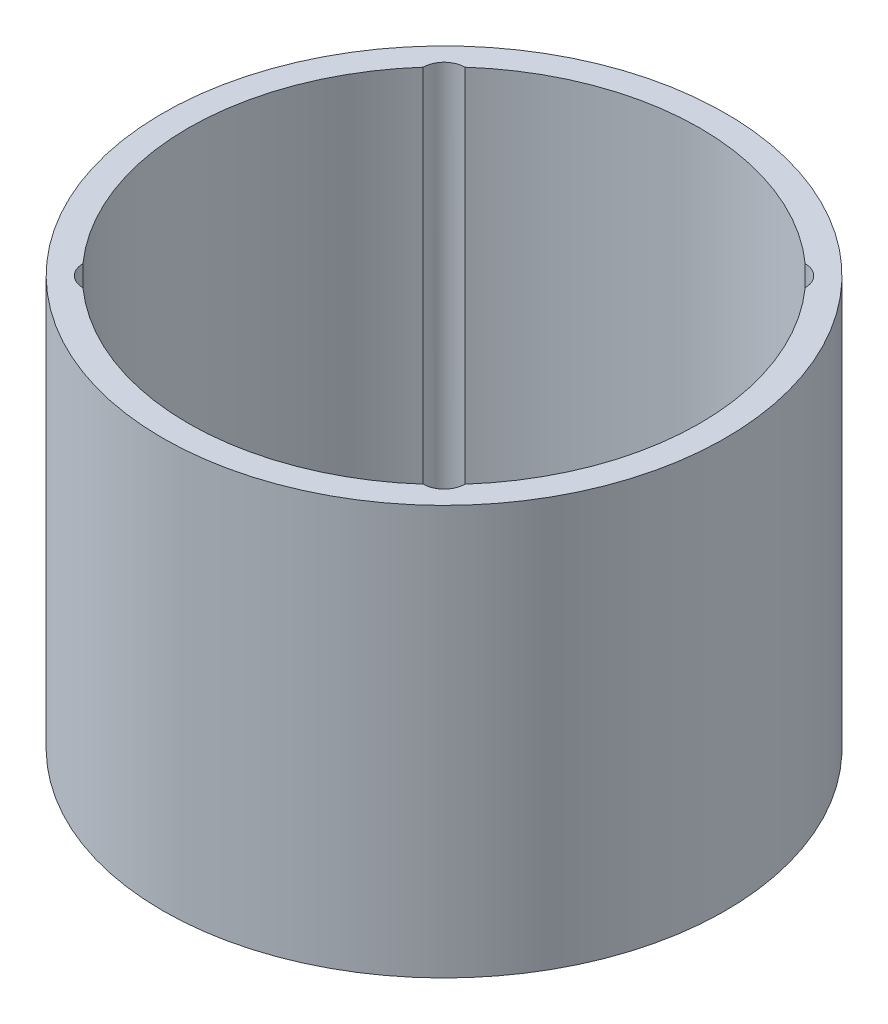
ISO-10303-21;
HEADER;
FILE_DESCRIPTION(('STEP AP214'),'2;1');
FILE_NAME('part.step','',(''),(''),'','','');
FILE_SCHEMA(('AUTOMOTIVE_DESIGN { 1 0 10303 214 1 1 1 1 }'));
ENDSEC;
DATA;
#1=APPLICATION_CONTEXT('core data for automotive mechanical design processes');
#2=APPLICATION_PROTOCOL_DEFINITION('international standard','automotive_design',2000,#1);
#3=PRODUCT_CONTEXT('',#1,'mechanical');
#4=PRODUCT('Part','Part','',(#3));
#5=PRODUCT_RELATED_PRODUCT_CATEGORY('part','',(#4));
#6=PRODUCT_DEFINITION_FORMATION('','',#4);
#7=PRODUCT_DEFINITION_CONTEXT('part definition',#1,'design');
#8=PRODUCT_DEFINITION('design','',#6,#7);
#9=PRODUCT_DEFINITION_SHAPE('','',#8);
#10=(LENGTH_UNIT() NAMED_UNIT(*) SI_UNIT(.MILLI.,.METRE.));
#11=(NAMED_UNIT(*) PLANE_ANGLE_UNIT() SI_UNIT($,.RADIAN.));
#12=(NAMED_UNIT(*) SI_UNIT($,.STERADIAN.) SOLID_ANGLE_UNIT());
#13=UNCERTAINTY_MEASURE_WITH_UNIT(LENGTH_MEASURE(1.E-05),#10,'distance_accuracy_value','');
#14=(GEOMETRIC_REPRESENTATION_CONTEXT(3) GLOBAL_UNCERTAINTY_ASSIGNED_CONTEXT((#13)) GLOBAL_UNIT_ASSIGNED_CONTEXT((#10,
#11,#12)) REPRESENTATION_CONTEXT('',''));
#15=CARTESIAN_POINT('',(0.,0.,0.));
#16=DIRECTION('',(0.,0.,1.));
#17=DIRECTION('',(1.,0.,0.));
#18=AXIS2_PLACEMENT_3D('',#15,#16,#17);
#19=CARTESIAN_POINT('',(0.,80.,0.));
#20=DIRECTION('',(0.,-1.,0.));
#21=DIRECTION('',(0.,0.,-1.));
#22=AXIS2_PLACEMENT_3D('',#19,#20,#21);
#23=CYLINDRICAL_SURFACE('',#22,50.);
#24=DIRECTION('',(0.,1.,0.));
#25=VECTOR('',#24,1.);
#26=CARTESIAN_POINT('',(-33.2592368748973,40.,-37.3339411594793));
#27=LINE('',#26,#25);
#28=CARTESIAN_POINT('',(-33.2592368748973,5.,-37.3339411594794));
#29=VERTEX_POINT('',#28);
#30=CARTESIAN_POINT('',(-33.2592368748974,80.,-37.3339411594793));
#31=VERTEX_POINT('',#30);
#32=EDGE_CURVE('E160',#29,#31,#27,.T.);
#33=ORIENTED_EDGE('',*,*,#32,.F.);
#34=CARTESIAN_POINT('',(0.,5.,0.));
#35=DIRECTION('',(0.,1.,0.));
#36=DIRECTION('',(0.,0.,1.));
#37=AXIS2_PLACEMENT_3D('',#34,#35,#36);
#38=CIRCLE('',#37,50.);
#39=CARTESIAN_POINT('',(33.2592368748973,5.,-37.3339411594794));
#40=VERTEX_POINT('',#39);
#41=EDGE_CURVE('E148',#40,#29,#38,.T.);
#42=ORIENTED_EDGE('',*,*,#41,.F.);
#43=DIRECTION('',(0.,1.,0.));
#44=VECTOR('',#43,1.);
#45=CARTESIAN_POINT('',(33.2592368748973,40.,-37.3339411594793));
#46=LINE('',#45,#44);
#47=CARTESIAN_POINT('',(33.2592368748974,80.,-37.3339411594793));
#48=VERTEX_POINT('',#47);
#49=EDGE_CURVE('E57',#48,#40,#46,.F.);
#50=ORIENTED_EDGE('',*,*,#49,.F.);
#51=CARTESIAN_POINT('',(0.,80.,0.));
#52=DIRECTION('',(0.,1.,0.));
#53=DIRECTION('',(0.,0.,1.));
#54=AXIS2_PLACEMENT_3D('',#51,#52,#53);
#55=CIRCLE('',#54,50.);
#56=EDGE_CURVE('E134',#48,#31,#55,.T.);
#57=ORIENTED_EDGE('',*,*,#56,.T.);
#58=EDGE_LOOP('',(#33,#42,#50,#57));
#59=FACE_BOUND('',#58,.T.);
#60=ADVANCED_FACE('F35',(#59),#23,.F.);
#61=DIRECTION('',(0.,1.,0.));
#62=VECTOR('',#61,1.);
#63=CARTESIAN_POINT('',(37.3339411594793,40.,-33.2592368748973));
#64=LINE('',#63,#62);
#65=CARTESIAN_POINT('',(37.3339411594794,5.,-33.2592368748973));
#66=VERTEX_POINT('',#65);
#67=CARTESIAN_POINT('',(37.3339411594793,80.,-33.2592368748974));
#68=VERTEX_POINT('',#67);
#69=EDGE_CURVE('E165',#66,#68,#64,.T.);
#70=ORIENTED_EDGE('',*,*,#69,.F.);
#71=CARTESIAN_POINT('',(37.3339411594794,5.,33.2592368748973));
#72=VERTEX_POINT('',#71);
#73=EDGE_CURVE('E143',#72,#66,#38,.T.);
#74=ORIENTED_EDGE('',*,*,#73,.F.);
#75=DIRECTION('',(0.,1.,0.));
#76=VECTOR('',#75,1.);
#77=CARTESIAN_POINT('',(37.3339411594794,40.,33.2592368748973));
#78=LINE('',#77,#76);
#79=CARTESIAN_POINT('',(37.3339411594794,80.,33.2592368748974));
#80=VERTEX_POINT('',#79);
#81=EDGE_CURVE('E110',#80,#72,#78,.F.);
#82=ORIENTED_EDGE('',*,*,#81,.F.);
#83=EDGE_CURVE('E122',#80,#68,#55,.T.);
#84=ORIENTED_EDGE('',*,*,#83,.T.);
#85=EDGE_LOOP('',(#70,#74,#82,#84));
#86=FACE_BOUND('',#85,.T.);
#87=ADVANCED_FACE('F194',(#86),#23,.F.);
#88=DIRECTION('',(0.,1.,0.));
#89=VECTOR('',#88,1.);
#90=CARTESIAN_POINT('',(33.2592368748973,40.,37.3339411594793));
#91=LINE('',#90,#89);
#92=CARTESIAN_POINT('',(33.2592368748973,5.,37.3339411594794));
#93=VERTEX_POINT('',#92);
#94=CARTESIAN_POINT('',(33.2592368748974,80.,37.3339411594793));
#95=VERTEX_POINT('',#94);
#96=EDGE_CURVE('E98',#93,#95,#91,.T.);
#97=ORIENTED_EDGE('',*,*,#96,.F.);
#98=CARTESIAN_POINT('',(-33.2592368748973,5.,37.3339411594794));
#99=VERTEX_POINT('',#98);
#100=EDGE_CURVE('E137',#99,#93,#38,.T.);
#101=ORIENTED_EDGE('',*,*,#100,.F.);
#102=DIRECTION('',(0.,1.,0.));
#103=VECTOR('',#102,1.);
#104=CARTESIAN_POINT('',(-33.2592368748973,40.,37.3339411594793));
#105=LINE('',#104,#103);
#106=CARTESIAN_POINT('',(-33.2592368748974,80.,37.3339411594793));
#107=VERTEX_POINT('',#106);
#108=EDGE_CURVE('E127',#107,#99,#105,.F.);
#109=ORIENTED_EDGE('',*,*,#108,.F.);
#110=EDGE_CURVE('E119',#107,#95,#55,.T.);
#111=ORIENTED_EDGE('',*,*,#110,.T.);
#112=EDGE_LOOP('',(#97,#101,#109,#111));
#113=FACE_BOUND('',#112,.T.);
#114=ADVANCED_FACE('F126',(#113),#23,.F.);
#115=CARTESIAN_POINT('',(0.,80.,0.));
#116=DIRECTION('',(0.,-1.,0.));
#117=DIRECTION('',(0.,0.,-1.));
#118=AXIS2_PLACEMENT_3D('',#115,#116,#117);
#119=CYLINDRICAL_SURFACE('',#118,55.);
#120=CARTESIAN_POINT('',(0.,80.,0.));
#121=DIRECTION('',(0.,1.,0.));
#122=DIRECTION('',(0.,0.,1.));
#123=AXIS2_PLACEMENT_3D('',#120,#121,#122);
#124=CIRCLE('',#123,55.);
#125=CARTESIAN_POINT('',(0.,80.,55.));
#126=VERTEX_POINT('',#125);
#127=EDGE_CURVE('E132',#126,#126,#124,.T.);
#128=ORIENTED_EDGE('',*,*,#127,.F.);
#129=EDGE_LOOP('',(#128));
#130=FACE_BOUND('',#129,.T.);
#131=CARTESIAN_POINT('',(0.,0.,0.));
#132=DIRECTION('',(0.,1.,0.));
#133=DIRECTION('',(0.,0.,1.));
#134=AXIS2_PLACEMENT_3D('',#131,#132,#133);
#135=CIRCLE('',#134,55.);
#136=CARTESIAN_POINT('',(0.,0.,55.));
#137=VERTEX_POINT('',#136);
#138=EDGE_CURVE('E128',#137,#137,#135,.T.);
#139=ORIENTED_EDGE('',*,*,#138,.T.);
#140=EDGE_LOOP('',(#139));
#141=FACE_BOUND('',#140,.T.);
#142=ADVANCED_FACE('F37',(#130,#141),#119,.T.);
#143=CARTESIAN_POINT('',(0.,80.,0.));
#144=DIRECTION('',(0.,1.,0.));
#145=DIRECTION('',(0.,0.,1.));
#146=AXIS2_PLACEMENT_3D('',#143,#144,#145);
#147=PLANE('',#146);
#148=CARTESIAN_POINT('',(-33.2340187157677,80.,-33.2340187157677));
#149=DIRECTION('',(0.,1.,0.));
#150=DIRECTION('',(0.,0.,1.));
#151=AXIS2_PLACEMENT_3D('',#148,#149,#150);
#152=CIRCLE('',#151,4.1);
#153=CARTESIAN_POINT('',(-37.3339411594793,80.,-33.2592368748974));
#154=VERTEX_POINT('',#153);
#155=EDGE_CURVE('E177',#31,#154,#152,.T.);
#156=ORIENTED_EDGE('',*,*,#155,.F.);
#157=ORIENTED_EDGE('',*,*,#56,.F.);
#158=CARTESIAN_POINT('',(33.2340187157677,80.,-33.2340187157677));
#159=DIRECTION('',(0.,1.,0.));
#160=DIRECTION('',(0.,0.,1.));
#161=AXIS2_PLACEMENT_3D('',#158,#159,#160);
#162=CIRCLE('',#161,4.1);
#163=EDGE_CURVE('E172',#68,#48,#162,.T.);
#164=ORIENTED_EDGE('',*,*,#163,.F.);
#165=ORIENTED_EDGE('',*,*,#83,.F.);
#166=CARTESIAN_POINT('',(33.2340187157677,80.,33.2340187157677));
#167=DIRECTION('',(0.,1.,0.));
#168=DIRECTION('',(0.,0.,1.));
#169=AXIS2_PLACEMENT_3D('',#166,#167,#168);
#170=CIRCLE('',#169,4.1);
#171=EDGE_CURVE('E102',#95,#80,#170,.T.);
#172=ORIENTED_EDGE('',*,*,#171,.F.);
#173=ORIENTED_EDGE('',*,*,#110,.F.);
#174=CARTESIAN_POINT('',(-33.2340187157677,80.,33.2340187157677));
#175=DIRECTION('',(0.,1.,0.));
#176=DIRECTION('',(0.,0.,1.));
#177=AXIS2_PLACEMENT_3D('',#174,#175,#176);
#178=CIRCLE('',#177,4.1);
#179=CARTESIAN_POINT('',(-37.3339411594793,80.,33.2592368748974));
#180=VERTEX_POINT('',#179);
#181=EDGE_CURVE('E158',#180,#107,#178,.T.);
#182=ORIENTED_EDGE('',*,*,#181,.F.);
#183=EDGE_CURVE('E130',#154,#180,#55,.T.);
#184=ORIENTED_EDGE('',*,*,#183,.F.);
#185=EDGE_LOOP('',(#156,#157,#164,#165,#172,#173,#182,#184));
#186=FACE_BOUND('',#185,.T.);
#187=ORIENTED_EDGE('',*,*,#127,.T.);
#188=EDGE_LOOP('',(#187));
#189=FACE_BOUND('',#188,.T.);
#190=ADVANCED_FACE('F116',(#186,#189),#147,.T.);
#191=CARTESIAN_POINT('',(0.,0.,0.));
#192=DIRECTION('',(0.,1.,0.));
#193=DIRECTION('',(0.,0.,1.));
#194=AXIS2_PLACEMENT_3D('',#191,#192,#193);
#195=PLANE('',#194);
#196=CARTESIAN_POINT('',(-33.2340187157677,0.,-33.2340187157677));
#197=DIRECTION('',(0.,1.,0.));
#198=DIRECTION('',(0.,0.,1.));
#199=AXIS2_PLACEMENT_3D('',#196,#197,#198);
#200=CIRCLE('',#199,4.1);
#201=CARTESIAN_POINT('',(-33.2340187157677,0.,-29.1340187157677));
#202=VERTEX_POINT('',#201);
#203=EDGE_CURVE('E168',#202,#202,#200,.T.);
#204=ORIENTED_EDGE('',*,*,#203,.T.);
#205=EDGE_LOOP('',(#204));
#206=FACE_BOUND('',#205,.T.);
#207=CARTESIAN_POINT('',(33.2340187157677,0.,-33.2340187157677));
#208=DIRECTION('',(0.,1.,0.));
#209=DIRECTION('',(0.,0.,1.));
#210=AXIS2_PLACEMENT_3D('',#207,#208,#209);
#211=CIRCLE('',#210,4.1);
#212=CARTESIAN_POINT('',(33.2340187157677,0.,-29.1340187157677));
#213=VERTEX_POINT('',#212);
#214=EDGE_CURVE('E174',#213,#213,#211,.T.);
#215=ORIENTED_EDGE('',*,*,#214,.T.);
#216=EDGE_LOOP('',(#215));
#217=FACE_BOUND('',#216,.T.);
#218=CARTESIAN_POINT('',(33.2340187157677,0.,33.2340187157677));
#219=DIRECTION('',(0.,1.,0.));
#220=DIRECTION('',(0.,0.,1.));
#221=AXIS2_PLACEMENT_3D('',#218,#219,#220);
#222=CIRCLE('',#221,4.1);
#223=CARTESIAN_POINT('',(33.2340187157677,0.,37.3340187157677));
#224=VERTEX_POINT('',#223);
#225=EDGE_CURVE('E123',#224,#224,#222,.T.);
#226=ORIENTED_EDGE('',*,*,#225,.T.);
#227=EDGE_LOOP('',(#226));
#228=FACE_BOUND('',#227,.T.);
#229=CARTESIAN_POINT('',(-33.2340187157677,0.,33.2340187157677));
#230=DIRECTION('',(0.,1.,0.));
#231=DIRECTION('',(0.,0.,1.));
#232=AXIS2_PLACEMENT_3D('',#229,#230,#231);
#233=CIRCLE('',#232,4.1);
#234=CARTESIAN_POINT('',(-33.2340187157677,0.,37.3340187157677));
#235=VERTEX_POINT('',#234);
#236=EDGE_CURVE('E155',#235,#235,#233,.T.);
#237=ORIENTED_EDGE('',*,*,#236,.T.);
#238=EDGE_LOOP('',(#237));
#239=FACE_BOUND('',#238,.T.);
#240=ORIENTED_EDGE('',*,*,#138,.F.);
#241=EDGE_LOOP('',(#240));
#242=FACE_BOUND('',#241,.T.);
#243=ADVANCED_FACE('F182',(#206,#217,#228,#239,#242),#195,.F.);
#244=DIRECTION('',(0.,1.,0.));
#245=VECTOR('',#244,1.);
#246=CARTESIAN_POINT('',(-37.3339411594793,40.,-33.2592368748973));
#247=LINE('',#246,#245);
#248=CARTESIAN_POINT('',(-37.3339411594794,5.,-33.2592368748973));
#249=VERTEX_POINT('',#248);
#250=EDGE_CURVE('E49',#154,#249,#247,.F.);
#251=ORIENTED_EDGE('',*,*,#250,.F.);
#252=ORIENTED_EDGE('',*,*,#183,.T.);
#253=DIRECTION('',(0.,1.,0.));
#254=VECTOR('',#253,1.);
#255=CARTESIAN_POINT('',(-37.3339411594793,40.,33.2592368748973));
#256=LINE('',#255,#254);
#257=CARTESIAN_POINT('',(-37.3339411594794,5.,33.2592368748973));
#258=VERTEX_POINT('',#257);
#259=EDGE_CURVE('E150',#258,#180,#256,.T.);
#260=ORIENTED_EDGE('',*,*,#259,.F.);
#261=EDGE_CURVE('E144',#249,#258,#38,.T.);
#262=ORIENTED_EDGE('',*,*,#261,.F.);
#263=EDGE_LOOP('',(#251,#252,#260,#262));
#264=FACE_BOUND('',#263,.T.);
#265=ADVANCED_FACE('F197',(#264),#23,.F.);
#266=CARTESIAN_POINT('',(0.,5.,0.));
#267=DIRECTION('',(0.,1.,0.));
#268=DIRECTION('',(0.,0.,1.));
#269=AXIS2_PLACEMENT_3D('',#266,#267,#268);
#270=PLANE('',#269);
#271=CARTESIAN_POINT('',(-33.2340187157677,5.,-33.2340187157677));
#272=DIRECTION('',(0.,1.,0.));
#273=DIRECTION('',(0.,0.,1.));
#274=AXIS2_PLACEMENT_3D('',#271,#272,#273);
#275=CIRCLE('',#274,4.1);
#276=EDGE_CURVE('E11',#249,#29,#275,.T.);
#277=ORIENTED_EDGE('',*,*,#276,.F.);
#278=ORIENTED_EDGE('',*,*,#261,.T.);
#279=CARTESIAN_POINT('',(-33.2340187157677,5.,33.2340187157677));
#280=DIRECTION('',(0.,1.,0.));
#281=DIRECTION('',(0.,0.,1.));
#282=AXIS2_PLACEMENT_3D('',#279,#280,#281);
#283=CIRCLE('',#282,4.1);
#284=EDGE_CURVE('E226',#99,#258,#283,.T.);
#285=ORIENTED_EDGE('',*,*,#284,.F.);
#286=ORIENTED_EDGE('',*,*,#100,.T.);
#287=CARTESIAN_POINT('',(33.2340187157677,5.,33.2340187157677));
#288=DIRECTION('',(0.,1.,0.));
#289=DIRECTION('',(0.,0.,1.));
#290=AXIS2_PLACEMENT_3D('',#287,#288,#289);
#291=CIRCLE('',#290,4.1);
#292=EDGE_CURVE('E105',#72,#93,#291,.T.);
#293=ORIENTED_EDGE('',*,*,#292,.F.);
#294=ORIENTED_EDGE('',*,*,#73,.T.);
#295=CARTESIAN_POINT('',(33.2340187157677,5.,-33.2340187157677));
#296=DIRECTION('',(0.,1.,0.));
#297=DIRECTION('',(0.,0.,1.));
#298=AXIS2_PLACEMENT_3D('',#295,#296,#297);
#299=CIRCLE('',#298,4.1);
#300=EDGE_CURVE('E43',#40,#66,#299,.T.);
#301=ORIENTED_EDGE('',*,*,#300,.F.);
#302=ORIENTED_EDGE('',*,*,#41,.T.);
#303=EDGE_LOOP('',(#277,#278,#285,#286,#293,#294,#301,#302));
#304=FACE_BOUND('',#303,.T.);
#305=ADVANCED_FACE('F206',(#304),#270,.T.);
#306=CARTESIAN_POINT('',(-33.2340187157677,0.,33.2340187157677));
#307=DIRECTION('',(0.,1.,0.));
#308=DIRECTION('',(0.,0.,1.));
#309=AXIS2_PLACEMENT_3D('',#306,#307,#308);
#310=CYLINDRICAL_SURFACE('',#309,4.1);
#311=ORIENTED_EDGE('',*,*,#259,.T.);
#312=ORIENTED_EDGE('',*,*,#181,.T.);
#313=ORIENTED_EDGE('',*,*,#108,.T.);
#314=ORIENTED_EDGE('',*,*,#284,.T.);
#315=EDGE_LOOP('',(#311,#312,#313,#314));
#316=FACE_BOUND('',#315,.T.);
#317=ORIENTED_EDGE('',*,*,#236,.F.);
#318=EDGE_LOOP('',(#317));
#319=FACE_BOUND('',#318,.T.);
#320=ADVANCED_FACE('F211',(#316,#319),#310,.F.);
#321=CARTESIAN_POINT('',(33.2340187157677,0.,33.2340187157677));
#322=DIRECTION('',(0.,1.,0.));
#323=DIRECTION('',(0.,0.,1.));
#324=AXIS2_PLACEMENT_3D('',#321,#322,#323);
#325=CYLINDRICAL_SURFACE('',#324,4.1);
#326=ORIENTED_EDGE('',*,*,#96,.T.);
#327=ORIENTED_EDGE('',*,*,#171,.T.);
#328=ORIENTED_EDGE('',*,*,#81,.T.);
#329=ORIENTED_EDGE('',*,*,#292,.T.);
#330=EDGE_LOOP('',(#326,#327,#328,#329));
#331=FACE_BOUND('',#330,.T.);
#332=ORIENTED_EDGE('',*,*,#225,.F.);
#333=EDGE_LOOP('',(#332));
#334=FACE_BOUND('',#333,.T.);
#335=ADVANCED_FACE('F100',(#331,#334),#325,.F.);
#336=CARTESIAN_POINT('',(33.2340187157677,0.,-33.2340187157677));
#337=DIRECTION('',(0.,1.,0.));
#338=DIRECTION('',(0.,0.,1.));
#339=AXIS2_PLACEMENT_3D('',#336,#337,#338);
#340=CYLINDRICAL_SURFACE('',#339,4.1);
#341=ORIENTED_EDGE('',*,*,#69,.T.);
#342=ORIENTED_EDGE('',*,*,#163,.T.);
#343=ORIENTED_EDGE('',*,*,#49,.T.);
#344=ORIENTED_EDGE('',*,*,#300,.T.);
#345=EDGE_LOOP('',(#341,#342,#343,#344));
#346=FACE_BOUND('',#345,.T.);
#347=ORIENTED_EDGE('',*,*,#214,.F.);
#348=EDGE_LOOP('',(#347));
#349=FACE_BOUND('',#348,.T.);
#350=ADVANCED_FACE('F187',(#346,#349),#340,.F.);
#351=CARTESIAN_POINT('',(-33.2340187157677,0.,-33.2340187157677));
#352=DIRECTION('',(0.,1.,0.));
#353=DIRECTION('',(0.,0.,1.));
#354=AXIS2_PLACEMENT_3D('',#351,#352,#353);
#355=CYLINDRICAL_SURFACE('',#354,4.1);
#356=ORIENTED_EDGE('',*,*,#32,.T.);
#357=ORIENTED_EDGE('',*,*,#155,.T.);
#358=ORIENTED_EDGE('',*,*,#250,.T.);
#359=ORIENTED_EDGE('',*,*,#276,.T.);
#360=EDGE_LOOP('',(#356,#357,#358,#359));
#361=FACE_BOUND('',#360,.T.);
#362=ORIENTED_EDGE('',*,*,#203,.F.);
#363=EDGE_LOOP('',(#362));
#364=FACE_BOUND('',#363,.T.);
#365=ADVANCED_FACE('F185',(#361,#364),#355,.F.);
#366=CLOSED_SHELL('',(#60,#87,#114,#142,#190,#243,#265,#305,#320,#335,#350,#365));
#367=MANIFOLD_SOLID_BREP('B2',#366);
#368=ADVANCED_BREP_SHAPE_REPRESENTATION('',(#18,#367),#14);
#369=SHAPE_DEFINITION_REPRESENTATION(#9,#368);
ENDSEC;
END-ISO-10303-21;
